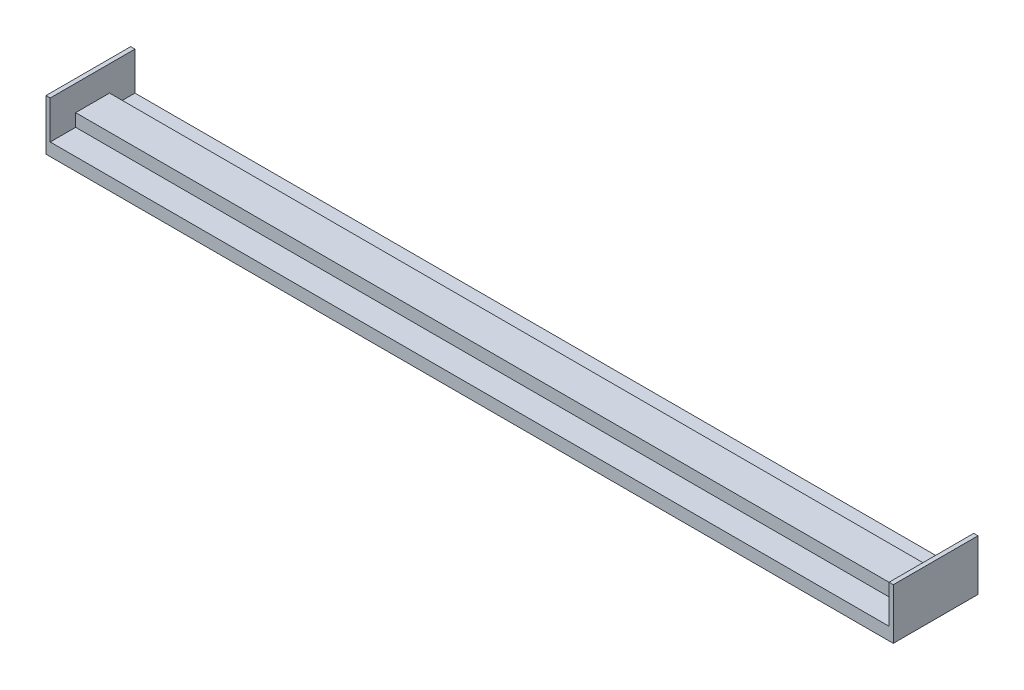
ISO-10303-21;
HEADER;
FILE_DESCRIPTION(('STEP AP214'),'2;1');
FILE_NAME('part.step','',(''),(''),'','','');
FILE_SCHEMA(('AUTOMOTIVE_DESIGN { 1 0 10303 214 1 1 1 1 }'));
ENDSEC;
DATA;
#1=APPLICATION_CONTEXT('core data for automotive mechanical design processes');
#2=APPLICATION_PROTOCOL_DEFINITION('international standard','automotive_design',2000,#1);
#3=PRODUCT_CONTEXT('',#1,'mechanical');
#4=PRODUCT('Part','Part','',(#3));
#5=PRODUCT_RELATED_PRODUCT_CATEGORY('part','',(#4));
#6=PRODUCT_DEFINITION_FORMATION('','',#4);
#7=PRODUCT_DEFINITION_CONTEXT('part definition',#1,'design');
#8=PRODUCT_DEFINITION('design','',#6,#7);
#9=PRODUCT_DEFINITION_SHAPE('','',#8);
#10=(LENGTH_UNIT() NAMED_UNIT(*) SI_UNIT(.MILLI.,.METRE.));
#11=(NAMED_UNIT(*) PLANE_ANGLE_UNIT() SI_UNIT($,.RADIAN.));
#12=(NAMED_UNIT(*) SI_UNIT($,.STERADIAN.) SOLID_ANGLE_UNIT());
#13=UNCERTAINTY_MEASURE_WITH_UNIT(LENGTH_MEASURE(1.E-05),#10,'distance_accuracy_value','');
#14=(GEOMETRIC_REPRESENTATION_CONTEXT(3) GLOBAL_UNCERTAINTY_ASSIGNED_CONTEXT((#13)) GLOBAL_UNIT_ASSIGNED_CONTEXT((#10,
#11,#12)) REPRESENTATION_CONTEXT('',''));
#15=CARTESIAN_POINT('',(0.,0.,0.));
#16=DIRECTION('',(0.,0.,1.));
#17=DIRECTION('',(1.,0.,0.));
#18=AXIS2_PLACEMENT_3D('',#15,#16,#17);
#19=CARTESIAN_POINT('',(-1000.,-7.50000000000002,0.));
#20=DIRECTION('',(0.,-1.,0.));
#21=DIRECTION('',(0.,0.,-1.));
#22=AXIS2_PLACEMENT_3D('',#19,#20,#21);
#23=PLANE('',#22);
#24=DIRECTION('',(0.,0.,-1.));
#25=VECTOR('',#24,1.);
#26=CARTESIAN_POINT('',(-995.,-7.50000000000002,0.));
#27=LINE('',#26,#25);
#28=CARTESIAN_POINT('',(-995.,-7.50000000000003,50.));
#29=VERTEX_POINT('',#28);
#30=CARTESIAN_POINT('',(-995.,-7.50000000000001,20.));
#31=VERTEX_POINT('',#30);
#32=EDGE_CURVE('E265',#29,#31,#27,.T.);
#33=ORIENTED_EDGE('',*,*,#32,.F.);
#34=DIRECTION('',(1.,0.,0.));
#35=VECTOR('',#34,1.);
#36=CARTESIAN_POINT('',(-1000.,-7.50000000000003,50.));
#37=LINE('',#36,#35);
#38=CARTESIAN_POINT('',(-5.,-7.50000000000003,50.));
#39=VERTEX_POINT('',#38);
#40=EDGE_CURVE('E113',#29,#39,#37,.T.);
#41=ORIENTED_EDGE('',*,*,#40,.T.);
#42=DIRECTION('',(0.,0.,-1.));
#43=VECTOR('',#42,1.);
#44=CARTESIAN_POINT('',(-5.,-7.50000000000002,0.));
#45=LINE('',#44,#43);
#46=CARTESIAN_POINT('',(-5.,-7.50000000000001,20.));
#47=VERTEX_POINT('',#46);
#48=EDGE_CURVE('E98',#39,#47,#45,.T.);
#49=ORIENTED_EDGE('',*,*,#48,.T.);
#50=DIRECTION('',(1.,0.,0.));
#51=VECTOR('',#50,1.);
#52=CARTESIAN_POINT('',(-1000.,-7.50000000000001,20.));
#53=LINE('',#52,#51);
#54=EDGE_CURVE('E117',#31,#47,#53,.T.);
#55=ORIENTED_EDGE('',*,*,#54,.F.);
#56=EDGE_LOOP('',(#33,#41,#49,#55));
#57=FACE_BOUND('',#56,.T.);
#58=ADVANCED_FACE('F39',(#57),#23,.F.);
#59=CARTESIAN_POINT('',(-1000.,0.,20.));
#60=DIRECTION('',(0.,0.,-1.));
#61=DIRECTION('',(-1.,0.,0.));
#62=AXIS2_PLACEMENT_3D('',#59,#60,#61);
#63=PLANE('',#62);
#64=DIRECTION('',(0.,1.,0.));
#65=VECTOR('',#64,1.);
#66=CARTESIAN_POINT('',(-995.,0.,20.));
#67=LINE('',#66,#65);
#68=CARTESIAN_POINT('',(-995.,7.5,20.));
#69=VERTEX_POINT('',#68);
#70=EDGE_CURVE('E261',#31,#69,#67,.T.);
#71=ORIENTED_EDGE('',*,*,#70,.F.);
#72=ORIENTED_EDGE('',*,*,#54,.T.);
#73=DIRECTION('',(0.,1.,0.));
#74=VECTOR('',#73,1.);
#75=CARTESIAN_POINT('',(-5.,0.,20.));
#76=LINE('',#75,#74);
#77=CARTESIAN_POINT('',(-5.,7.5,20.));
#78=VERTEX_POINT('',#77);
#79=EDGE_CURVE('E171',#47,#78,#76,.T.);
#80=ORIENTED_EDGE('',*,*,#79,.T.);
#81=DIRECTION('',(1.,0.,0.));
#82=VECTOR('',#81,1.);
#83=CARTESIAN_POINT('',(-1000.,7.5,20.));
#84=LINE('',#83,#82);
#85=EDGE_CURVE('E121',#69,#78,#84,.T.);
#86=ORIENTED_EDGE('',*,*,#85,.F.);
#87=EDGE_LOOP('',(#71,#72,#80,#86));
#88=FACE_BOUND('',#87,.T.);
#89=ADVANCED_FACE('F208',(#88),#63,.F.);
#90=CARTESIAN_POINT('',(-1000.,7.5,0.));
#91=DIRECTION('',(0.,1.,0.));
#92=DIRECTION('',(0.,0.,1.));
#93=AXIS2_PLACEMENT_3D('',#90,#91,#92);
#94=PLANE('',#93);
#95=DIRECTION('',(1.,0.,0.));
#96=VECTOR('',#95,1.);
#97=CARTESIAN_POINT('',(-1000.,7.5,-20.));
#98=LINE('',#97,#96);
#99=CARTESIAN_POINT('',(-995.,7.5,-20.));
#100=VERTEX_POINT('',#99);
#101=CARTESIAN_POINT('',(-5.,7.5,-20.));
#102=VERTEX_POINT('',#101);
#103=EDGE_CURVE('E125',#100,#102,#98,.T.);
#104=ORIENTED_EDGE('',*,*,#103,.F.);
#105=DIRECTION('',(0.,0.,1.));
#106=VECTOR('',#105,1.);
#107=CARTESIAN_POINT('',(-995.,7.5,0.));
#108=LINE('',#107,#106);
#109=EDGE_CURVE('E234',#100,#69,#108,.T.);
#110=ORIENTED_EDGE('',*,*,#109,.T.);
#111=ORIENTED_EDGE('',*,*,#85,.T.);
#112=DIRECTION('',(0.,0.,1.));
#113=VECTOR('',#112,1.);
#114=CARTESIAN_POINT('',(-5.,7.5,0.));
#115=LINE('',#114,#113);
#116=EDGE_CURVE('E166',#102,#78,#115,.T.);
#117=ORIENTED_EDGE('',*,*,#116,.F.);
#118=EDGE_LOOP('',(#104,#110,#111,#117));
#119=FACE_BOUND('',#118,.T.);
#120=ADVANCED_FACE('F214',(#119),#94,.T.);
#121=CARTESIAN_POINT('',(-1000.,0.,-20.));
#122=DIRECTION('',(0.,0.,-1.));
#123=DIRECTION('',(-1.,0.,0.));
#124=AXIS2_PLACEMENT_3D('',#121,#122,#123);
#125=PLANE('',#124);
#126=DIRECTION('',(1.,0.,0.));
#127=VECTOR('',#126,1.);
#128=CARTESIAN_POINT('',(-1000.,-7.50000000000001,-20.));
#129=LINE('',#128,#127);
#130=CARTESIAN_POINT('',(-995.,-7.50000000000002,-20.));
#131=VERTEX_POINT('',#130);
#132=CARTESIAN_POINT('',(-5.,-7.50000000000002,-20.));
#133=VERTEX_POINT('',#132);
#134=EDGE_CURVE('E129',#131,#133,#129,.T.);
#135=ORIENTED_EDGE('',*,*,#134,.F.);
#136=DIRECTION('',(0.,1.,0.));
#137=VECTOR('',#136,1.);
#138=CARTESIAN_POINT('',(-995.,0.,-20.));
#139=LINE('',#138,#137);
#140=EDGE_CURVE('E298',#131,#100,#139,.T.);
#141=ORIENTED_EDGE('',*,*,#140,.T.);
#142=ORIENTED_EDGE('',*,*,#103,.T.);
#143=DIRECTION('',(0.,1.,0.));
#144=VECTOR('',#143,1.);
#145=CARTESIAN_POINT('',(-5.,0.,-20.));
#146=LINE('',#145,#144);
#147=EDGE_CURVE('E155',#133,#102,#146,.T.);
#148=ORIENTED_EDGE('',*,*,#147,.F.);
#149=EDGE_LOOP('',(#135,#141,#142,#148));
#150=FACE_BOUND('',#149,.T.);
#151=ADVANCED_FACE('F161',(#150),#125,.T.);
#152=DIRECTION('',(0.,0.,-1.));
#153=VECTOR('',#152,1.);
#154=CARTESIAN_POINT('',(-995.,-7.50000000000002,0.));
#155=LINE('',#154,#153);
#156=CARTESIAN_POINT('',(-995.,-7.50000000000001,-50.));
#157=VERTEX_POINT('',#156);
#158=EDGE_CURVE('E11',#131,#157,#155,.T.);
#159=ORIENTED_EDGE('',*,*,#158,.F.);
#160=ORIENTED_EDGE('',*,*,#134,.T.);
#161=DIRECTION('',(0.,0.,-1.));
#162=VECTOR('',#161,1.);
#163=CARTESIAN_POINT('',(-5.,-7.50000000000002,0.));
#164=LINE('',#163,#162);
#165=CARTESIAN_POINT('',(-5.,-7.50000000000001,-50.));
#166=VERTEX_POINT('',#165);
#167=EDGE_CURVE('E48',#133,#166,#164,.T.);
#168=ORIENTED_EDGE('',*,*,#167,.T.);
#169=DIRECTION('',(1.,0.,0.));
#170=VECTOR('',#169,1.);
#171=CARTESIAN_POINT('',(-1000.,-7.50000000000001,-50.));
#172=LINE('',#171,#170);
#173=EDGE_CURVE('E133',#157,#166,#172,.T.);
#174=ORIENTED_EDGE('',*,*,#173,.F.);
#175=EDGE_LOOP('',(#159,#160,#168,#174));
#176=FACE_BOUND('',#175,.T.);
#177=ADVANCED_FACE('F142',(#176),#23,.F.);
#178=CARTESIAN_POINT('',(-1000.,0.,-50.));
#179=DIRECTION('',(0.,0.,1.));
#180=DIRECTION('',(1.,0.,0.));
#181=AXIS2_PLACEMENT_3D('',#178,#179,#180);
#182=PLANE('',#181);
#183=DIRECTION('',(0.,-1.,0.));
#184=VECTOR('',#183,1.);
#185=CARTESIAN_POINT('',(-1000.,0.,-50.));
#186=LINE('',#185,#184);
#187=CARTESIAN_POINT('',(-1000.,37.5,-50.));
#188=VERTEX_POINT('',#187);
#189=CARTESIAN_POINT('',(-1000.,-22.5,-50.));
#190=VERTEX_POINT('',#189);
#191=EDGE_CURVE('E63',#188,#190,#186,.T.);
#192=ORIENTED_EDGE('',*,*,#191,.F.);
#193=DIRECTION('',(1.,0.,0.));
#194=VECTOR('',#193,1.);
#195=CARTESIAN_POINT('',(-1000.,37.5,-50.));
#196=LINE('',#195,#194);
#197=CARTESIAN_POINT('',(-995.,37.5,-50.));
#198=VERTEX_POINT('',#197);
#199=EDGE_CURVE('E279',#188,#198,#196,.T.);
#200=ORIENTED_EDGE('',*,*,#199,.T.);
#201=DIRECTION('',(0.,-1.,0.));
#202=VECTOR('',#201,1.);
#203=CARTESIAN_POINT('',(-995.,-22.5,-50.));
#204=LINE('',#203,#202);
#205=EDGE_CURVE('E55',#198,#157,#204,.T.);
#206=ORIENTED_EDGE('',*,*,#205,.T.);
#207=ORIENTED_EDGE('',*,*,#173,.T.);
#208=DIRECTION('',(0.,-1.,0.));
#209=VECTOR('',#208,1.);
#210=CARTESIAN_POINT('',(-5.,-22.5,-50.));
#211=LINE('',#210,#209);
#212=CARTESIAN_POINT('',(-5.,37.5,-50.));
#213=VERTEX_POINT('',#212);
#214=EDGE_CURVE('E158',#213,#166,#211,.T.);
#215=ORIENTED_EDGE('',*,*,#214,.F.);
#216=DIRECTION('',(-1.,0.,0.));
#217=VECTOR('',#216,1.);
#218=CARTESIAN_POINT('',(0.,37.5,-50.));
#219=LINE('',#218,#217);
#220=CARTESIAN_POINT('',(0.,37.5,-50.));
#221=VERTEX_POINT('',#220);
#222=EDGE_CURVE('E92',#221,#213,#219,.T.);
#223=ORIENTED_EDGE('',*,*,#222,.F.);
#224=DIRECTION('',(0.,-1.,0.));
#225=VECTOR('',#224,1.);
#226=CARTESIAN_POINT('',(0.,0.,-50.));
#227=LINE('',#226,#225);
#228=CARTESIAN_POINT('',(0.,-22.5,-50.));
#229=VERTEX_POINT('',#228);
#230=EDGE_CURVE('E88',#221,#229,#227,.T.);
#231=ORIENTED_EDGE('',*,*,#230,.T.);
#232=DIRECTION('',(1.,0.,0.));
#233=VECTOR('',#232,1.);
#234=CARTESIAN_POINT('',(-1000.,-22.5,-50.));
#235=LINE('',#234,#233);
#236=EDGE_CURVE('E77',#190,#229,#235,.T.);
#237=ORIENTED_EDGE('',*,*,#236,.F.);
#238=EDGE_LOOP('',(#192,#200,#206,#207,#215,#223,#231,#237));
#239=FACE_BOUND('',#238,.T.);
#240=ADVANCED_FACE('F41',(#239),#182,.F.);
#241=CARTESIAN_POINT('',(-1000.,-22.5,0.));
#242=DIRECTION('',(0.,-1.,0.));
#243=DIRECTION('',(0.,0.,-1.));
#244=AXIS2_PLACEMENT_3D('',#241,#242,#243);
#245=PLANE('',#244);
#246=ORIENTED_EDGE('',*,*,#236,.T.);
#247=DIRECTION('',(0.,0.,-1.));
#248=VECTOR('',#247,1.);
#249=CARTESIAN_POINT('',(0.,-22.5,0.));
#250=LINE('',#249,#248);
#251=CARTESIAN_POINT('',(0.,-22.5,50.));
#252=VERTEX_POINT('',#251);
#253=EDGE_CURVE('E81',#252,#229,#250,.T.);
#254=ORIENTED_EDGE('',*,*,#253,.F.);
#255=DIRECTION('',(1.,0.,0.));
#256=VECTOR('',#255,1.);
#257=CARTESIAN_POINT('',(-1000.,-22.5,50.));
#258=LINE('',#257,#256);
#259=CARTESIAN_POINT('',(-1000.,-22.5,50.));
#260=VERTEX_POINT('',#259);
#261=EDGE_CURVE('E84',#260,#252,#258,.T.);
#262=ORIENTED_EDGE('',*,*,#261,.F.);
#263=DIRECTION('',(0.,0.,-1.));
#264=VECTOR('',#263,1.);
#265=CARTESIAN_POINT('',(-1000.,-22.5,0.));
#266=LINE('',#265,#264);
#267=EDGE_CURVE('E82',#260,#190,#266,.T.);
#268=ORIENTED_EDGE('',*,*,#267,.T.);
#269=EDGE_LOOP('',(#246,#254,#262,#268));
#270=FACE_BOUND('',#269,.T.);
#271=ADVANCED_FACE('F79',(#270),#245,.T.);
#272=CARTESIAN_POINT('',(-1000.,0.,50.));
#273=DIRECTION('',(0.,0.,1.));
#274=DIRECTION('',(1.,0.,0.));
#275=AXIS2_PLACEMENT_3D('',#272,#273,#274);
#276=PLANE('',#275);
#277=ORIENTED_EDGE('',*,*,#261,.T.);
#278=DIRECTION('',(0.,-1.,0.));
#279=VECTOR('',#278,1.);
#280=CARTESIAN_POINT('',(0.,0.,50.));
#281=LINE('',#280,#279);
#282=CARTESIAN_POINT('',(0.,37.5,50.));
#283=VERTEX_POINT('',#282);
#284=EDGE_CURVE('E97',#283,#252,#281,.T.);
#285=ORIENTED_EDGE('',*,*,#284,.F.);
#286=DIRECTION('',(-1.,0.,0.));
#287=VECTOR('',#286,1.);
#288=CARTESIAN_POINT('',(0.,37.5,50.));
#289=LINE('',#288,#287);
#290=CARTESIAN_POINT('',(-5.,37.5,50.));
#291=VERTEX_POINT('',#290);
#292=EDGE_CURVE('E308',#283,#291,#289,.T.);
#293=ORIENTED_EDGE('',*,*,#292,.T.);
#294=DIRECTION('',(0.,-1.,0.));
#295=VECTOR('',#294,1.);
#296=CARTESIAN_POINT('',(-5.,-22.5,50.));
#297=LINE('',#296,#295);
#298=EDGE_CURVE('E270',#291,#39,#297,.T.);
#299=ORIENTED_EDGE('',*,*,#298,.T.);
#300=ORIENTED_EDGE('',*,*,#40,.F.);
#301=DIRECTION('',(0.,-1.,0.));
#302=VECTOR('',#301,1.);
#303=CARTESIAN_POINT('',(-995.,-22.5,50.));
#304=LINE('',#303,#302);
#305=CARTESIAN_POINT('',(-995.,37.5,50.));
#306=VERTEX_POINT('',#305);
#307=EDGE_CURVE('E268',#306,#29,#304,.T.);
#308=ORIENTED_EDGE('',*,*,#307,.F.);
#309=DIRECTION('',(1.,0.,0.));
#310=VECTOR('',#309,1.);
#311=CARTESIAN_POINT('',(-1000.,37.5,50.));
#312=LINE('',#311,#310);
#313=CARTESIAN_POINT('',(-1000.,37.5,50.));
#314=VERTEX_POINT('',#313);
#315=EDGE_CURVE('E195',#314,#306,#312,.T.);
#316=ORIENTED_EDGE('',*,*,#315,.F.);
#317=DIRECTION('',(0.,-1.,0.));
#318=VECTOR('',#317,1.);
#319=CARTESIAN_POINT('',(-1000.,0.,50.));
#320=LINE('',#319,#318);
#321=EDGE_CURVE('E107',#314,#260,#320,.T.);
#322=ORIENTED_EDGE('',*,*,#321,.T.);
#323=EDGE_LOOP('',(#277,#285,#293,#299,#300,#308,#316,#322));
#324=FACE_BOUND('',#323,.T.);
#325=ADVANCED_FACE('F191',(#324),#276,.T.);
#326=CARTESIAN_POINT('',(-1000.,0.,0.));
#327=DIRECTION('',(1.,0.,0.));
#328=DIRECTION('',(0.,0.,-1.));
#329=AXIS2_PLACEMENT_3D('',#326,#327,#328);
#330=PLANE('',#329);
#331=ORIENTED_EDGE('',*,*,#321,.F.);
#332=DIRECTION('',(0.,0.,1.));
#333=VECTOR('',#332,1.);
#334=CARTESIAN_POINT('',(-1000.,37.5,-50.));
#335=LINE('',#334,#333);
#336=EDGE_CURVE('E287',#188,#314,#335,.T.);
#337=ORIENTED_EDGE('',*,*,#336,.F.);
#338=ORIENTED_EDGE('',*,*,#191,.T.);
#339=ORIENTED_EDGE('',*,*,#267,.F.);
#340=EDGE_LOOP('',(#331,#337,#338,#339));
#341=FACE_BOUND('',#340,.T.);
#342=ADVANCED_FACE('F197',(#341),#330,.F.);
#343=CARTESIAN_POINT('',(0.,0.,0.));
#344=DIRECTION('',(1.,0.,0.));
#345=DIRECTION('',(0.,0.,-1.));
#346=AXIS2_PLACEMENT_3D('',#343,#344,#345);
#347=PLANE('',#346);
#348=DIRECTION('',(0.,0.,1.));
#349=VECTOR('',#348,1.);
#350=CARTESIAN_POINT('',(0.,37.5,-50.));
#351=LINE('',#350,#349);
#352=EDGE_CURVE('E174',#221,#283,#351,.T.);
#353=ORIENTED_EDGE('',*,*,#352,.T.);
#354=ORIENTED_EDGE('',*,*,#284,.T.);
#355=ORIENTED_EDGE('',*,*,#253,.T.);
#356=ORIENTED_EDGE('',*,*,#230,.F.);
#357=EDGE_LOOP('',(#353,#354,#355,#356));
#358=FACE_BOUND('',#357,.T.);
#359=ADVANCED_FACE('F101',(#358),#347,.T.);
#360=CARTESIAN_POINT('',(-5.,-22.5,-50.));
#361=DIRECTION('',(-1.,0.,0.));
#362=DIRECTION('',(0.,0.,1.));
#363=AXIS2_PLACEMENT_3D('',#360,#361,#362);
#364=PLANE('',#363);
#365=ORIENTED_EDGE('',*,*,#48,.F.);
#366=ORIENTED_EDGE('',*,*,#298,.F.);
#367=DIRECTION('',(0.,0.,1.));
#368=VECTOR('',#367,1.);
#369=CARTESIAN_POINT('',(-5.,37.5,-50.));
#370=LINE('',#369,#368);
#371=EDGE_CURVE('E167',#213,#291,#370,.T.);
#372=ORIENTED_EDGE('',*,*,#371,.F.);
#373=ORIENTED_EDGE('',*,*,#214,.T.);
#374=ORIENTED_EDGE('',*,*,#167,.F.);
#375=ORIENTED_EDGE('',*,*,#147,.T.);
#376=ORIENTED_EDGE('',*,*,#116,.T.);
#377=ORIENTED_EDGE('',*,*,#79,.F.);
#378=EDGE_LOOP('',(#365,#366,#372,#373,#374,#375,#376,#377));
#379=FACE_BOUND('',#378,.T.);
#380=ADVANCED_FACE('F152',(#379),#364,.T.);
#381=CARTESIAN_POINT('',(0.,37.5,-50.));
#382=DIRECTION('',(0.,1.,0.));
#383=DIRECTION('',(0.,0.,1.));
#384=AXIS2_PLACEMENT_3D('',#381,#382,#383);
#385=PLANE('',#384);
#386=ORIENTED_EDGE('',*,*,#292,.F.);
#387=ORIENTED_EDGE('',*,*,#352,.F.);
#388=ORIENTED_EDGE('',*,*,#222,.T.);
#389=ORIENTED_EDGE('',*,*,#371,.T.);
#390=EDGE_LOOP('',(#386,#387,#388,#389));
#391=FACE_BOUND('',#390,.T.);
#392=ADVANCED_FACE('F319',(#391),#385,.T.);
#393=CARTESIAN_POINT('',(-995.,-22.5,-50.));
#394=DIRECTION('',(-1.,0.,0.));
#395=DIRECTION('',(0.,0.,1.));
#396=AXIS2_PLACEMENT_3D('',#393,#394,#395);
#397=PLANE('',#396);
#398=ORIENTED_EDGE('',*,*,#307,.T.);
#399=ORIENTED_EDGE('',*,*,#32,.T.);
#400=ORIENTED_EDGE('',*,*,#70,.T.);
#401=ORIENTED_EDGE('',*,*,#109,.F.);
#402=ORIENTED_EDGE('',*,*,#140,.F.);
#403=ORIENTED_EDGE('',*,*,#158,.T.);
#404=ORIENTED_EDGE('',*,*,#205,.F.);
#405=DIRECTION('',(0.,0.,1.));
#406=VECTOR('',#405,1.);
#407=CARTESIAN_POINT('',(-995.,37.5,-50.));
#408=LINE('',#407,#406);
#409=EDGE_CURVE('E283',#198,#306,#408,.T.);
#410=ORIENTED_EDGE('',*,*,#409,.T.);
#411=EDGE_LOOP('',(#398,#399,#400,#401,#402,#403,#404,#410));
#412=FACE_BOUND('',#411,.T.);
#413=ADVANCED_FACE('F289',(#412),#397,.F.);
#414=CARTESIAN_POINT('',(-1000.,37.5,-50.));
#415=DIRECTION('',(0.,-1.,0.));
#416=DIRECTION('',(0.,0.,-1.));
#417=AXIS2_PLACEMENT_3D('',#414,#415,#416);
#418=PLANE('',#417);
#419=ORIENTED_EDGE('',*,*,#315,.T.);
#420=ORIENTED_EDGE('',*,*,#409,.F.);
#421=ORIENTED_EDGE('',*,*,#199,.F.);
#422=ORIENTED_EDGE('',*,*,#336,.T.);
#423=EDGE_LOOP('',(#419,#420,#421,#422));
#424=FACE_BOUND('',#423,.T.);
#425=ADVANCED_FACE('F285',(#424),#418,.F.);
#426=CLOSED_SHELL('',(#58,#89,#120,#151,#177,#240,#271,#325,#342,#359,#380,#392,#413,#425));
#427=MANIFOLD_SOLID_BREP('B2',#426);
#428=ADVANCED_BREP_SHAPE_REPRESENTATION('',(#18,#427),#14);
#429=SHAPE_DEFINITION_REPRESENTATION(#9,#428);
ENDSEC;
END-ISO-10303-21;
